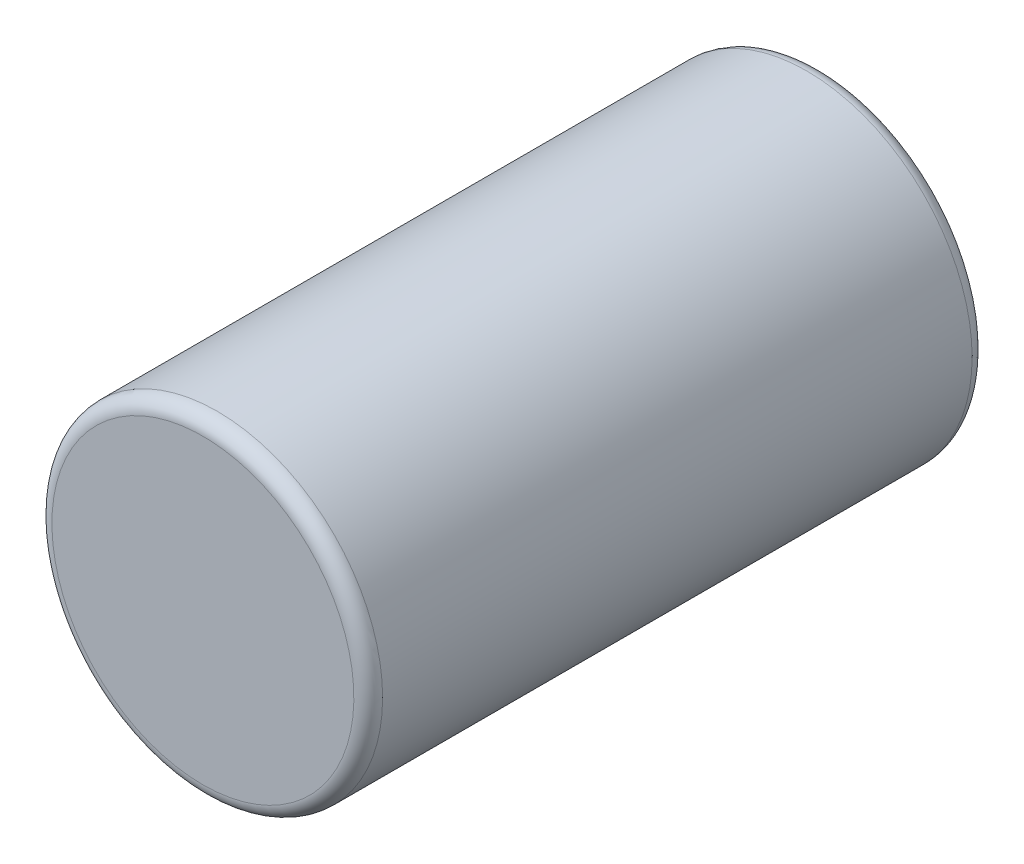
ISO-10303-21;
HEADER;
FILE_DESCRIPTION(('STEP AP214'),'2;1');
FILE_NAME('part.step','',(''),(''),'','','');
FILE_SCHEMA(('AUTOMOTIVE_DESIGN { 1 0 10303 214 1 1 1 1 }'));
ENDSEC;
DATA;
#1=APPLICATION_CONTEXT('core data for automotive mechanical design processes');
#2=APPLICATION_PROTOCOL_DEFINITION('international standard','automotive_design',2000,#1);
#3=PRODUCT_CONTEXT('',#1,'mechanical');
#4=PRODUCT('Part','Part','',(#3));
#5=PRODUCT_RELATED_PRODUCT_CATEGORY('part','',(#4));
#6=PRODUCT_DEFINITION_FORMATION('','',#4);
#7=PRODUCT_DEFINITION_CONTEXT('part definition',#1,'design');
#8=PRODUCT_DEFINITION('design','',#6,#7);
#9=PRODUCT_DEFINITION_SHAPE('','',#8);
#10=(LENGTH_UNIT() NAMED_UNIT(*) SI_UNIT(.MILLI.,.METRE.));
#11=(NAMED_UNIT(*) PLANE_ANGLE_UNIT() SI_UNIT($,.RADIAN.));
#12=(NAMED_UNIT(*) SI_UNIT($,.STERADIAN.) SOLID_ANGLE_UNIT());
#13=UNCERTAINTY_MEASURE_WITH_UNIT(LENGTH_MEASURE(1.E-05),#10,'distance_accuracy_value','');
#14=(GEOMETRIC_REPRESENTATION_CONTEXT(3) GLOBAL_UNCERTAINTY_ASSIGNED_CONTEXT((#13)) GLOBAL_UNIT_ASSIGNED_CONTEXT((#10,
#11,#12)) REPRESENTATION_CONTEXT('',''));
#15=CARTESIAN_POINT('',(0.,0.,0.));
#16=DIRECTION('',(0.,0.,1.));
#17=DIRECTION('',(1.,0.,0.));
#18=AXIS2_PLACEMENT_3D('',#15,#16,#17);
#19=CARTESIAN_POINT('',(0.,0.,0.));
#20=DIRECTION('',(0.,0.,-1.));
#21=DIRECTION('',(0.,1.,0.));
#22=AXIS2_PLACEMENT_3D('',#19,#20,#21);
#23=PLANE('',#22);
#24=CARTESIAN_POINT('',(0.,0.,0.));
#25=DIRECTION('',(0.,0.,1.));
#26=DIRECTION('',(0.,-1.,0.));
#27=AXIS2_PLACEMENT_3D('',#24,#25,#26);
#28=CIRCLE('',#27,10.5);
#29=CARTESIAN_POINT('',(0.,-10.5,0.));
#30=VERTEX_POINT('',#29);
#31=EDGE_CURVE('E10',#30,#30,#28,.T.);
#32=ORIENTED_EDGE('',*,*,#31,.T.);
#33=EDGE_LOOP('',(#32));
#34=FACE_BOUND('',#33,.T.);
#35=ADVANCED_FACE('F33',(#34),#23,.F.);
#36=CARTESIAN_POINT('',(0.,0.,-1.));
#37=DIRECTION('',(0.,0.,1.));
#38=DIRECTION('',(0.,-1.,0.));
#39=AXIS2_PLACEMENT_3D('',#36,#37,#38);
#40=TOROIDAL_SURFACE('',#39,10.5,1.);
#41=ORIENTED_EDGE('',*,*,#31,.F.);
#42=EDGE_LOOP('',(#41));
#43=FACE_BOUND('',#42,.T.);
#44=CARTESIAN_POINT('',(0.,0.,-1.00000000000001));
#45=DIRECTION('',(0.,0.,1.));
#46=DIRECTION('',(0.,-1.,0.));
#47=AXIS2_PLACEMENT_3D('',#44,#45,#46);
#48=CIRCLE('',#47,11.5);
#49=CARTESIAN_POINT('',(0.,-11.5,-1.00000000000001));
#50=VERTEX_POINT('',#49);
#51=EDGE_CURVE('E39',#50,#50,#48,.T.);
#52=ORIENTED_EDGE('',*,*,#51,.T.);
#53=EDGE_LOOP('',(#52));
#54=FACE_BOUND('',#53,.T.);
#55=ADVANCED_FACE('F77',(#43,#54),#40,.T.);
#56=CARTESIAN_POINT('',(0.,0.,0.));
#57=DIRECTION('',(0.,0.,1.));
#58=DIRECTION('',(0.,-1.,0.));
#59=AXIS2_PLACEMENT_3D('',#56,#57,#58);
#60=CYLINDRICAL_SURFACE('',#59,11.5);
#61=ORIENTED_EDGE('',*,*,#51,.F.);
#62=EDGE_LOOP('',(#61));
#63=FACE_BOUND('',#62,.T.);
#64=CARTESIAN_POINT('',(0.,0.,-42.));
#65=DIRECTION('',(0.,0.,1.));
#66=DIRECTION('',(0.,-1.,0.));
#67=AXIS2_PLACEMENT_3D('',#64,#65,#66);
#68=CIRCLE('',#67,11.5);
#69=CARTESIAN_POINT('',(0.,-11.5,-42.));
#70=VERTEX_POINT('',#69);
#71=EDGE_CURVE('E43',#70,#70,#68,.T.);
#72=ORIENTED_EDGE('',*,*,#71,.T.);
#73=EDGE_LOOP('',(#72));
#74=FACE_BOUND('',#73,.T.);
#75=ADVANCED_FACE('F81',(#63,#74),#60,.T.);
#76=CARTESIAN_POINT('',(0.,0.,-42.));
#77=DIRECTION('',(0.,0.,1.));
#78=DIRECTION('',(0.,-1.,0.));
#79=AXIS2_PLACEMENT_3D('',#76,#77,#78);
#80=TOROIDAL_SURFACE('',#79,10.5,1.);
#81=ORIENTED_EDGE('',*,*,#71,.F.);
#82=EDGE_LOOP('',(#81));
#83=FACE_BOUND('',#82,.T.);
#84=CARTESIAN_POINT('',(0.,0.,-43.));
#85=DIRECTION('',(0.,0.,1.));
#86=DIRECTION('',(0.,-1.,0.));
#87=AXIS2_PLACEMENT_3D('',#84,#85,#86);
#88=CIRCLE('',#87,10.5);
#89=CARTESIAN_POINT('',(0.,-10.5,-43.));
#90=VERTEX_POINT('',#89);
#91=EDGE_CURVE('E47',#90,#90,#88,.T.);
#92=ORIENTED_EDGE('',*,*,#91,.T.);
#93=EDGE_LOOP('',(#92));
#94=FACE_BOUND('',#93,.T.);
#95=ADVANCED_FACE('F86',(#83,#94),#80,.T.);
#96=CARTESIAN_POINT('',(0.,10.5,-43.));
#97=DIRECTION('',(0.,0.,1.));
#98=DIRECTION('',(0.,-1.,0.));
#99=AXIS2_PLACEMENT_3D('',#96,#97,#98);
#100=PLANE('',#99);
#101=ORIENTED_EDGE('',*,*,#91,.F.);
#102=EDGE_LOOP('',(#101));
#103=FACE_BOUND('',#102,.T.);
#104=CARTESIAN_POINT('',(0.,0.,-43.));
#105=DIRECTION('',(0.,0.,1.));
#106=DIRECTION('',(0.,-1.,0.));
#107=AXIS2_PLACEMENT_3D('',#104,#105,#106);
#108=CIRCLE('',#107,8.);
#109=CARTESIAN_POINT('',(0.,-8.,-43.));
#110=VERTEX_POINT('',#109);
#111=EDGE_CURVE('E52',#110,#110,#108,.T.);
#112=ORIENTED_EDGE('',*,*,#111,.T.);
#113=EDGE_LOOP('',(#112));
#114=FACE_BOUND('',#113,.T.);
#115=ADVANCED_FACE('F92',(#103,#114),#100,.F.);
#116=CARTESIAN_POINT('',(0.,0.,-42.5));
#117=DIRECTION('',(0.,0.,-1.));
#118=DIRECTION('',(0.,1.,0.));
#119=AXIS2_PLACEMENT_3D('',#116,#117,#118);
#120=CONICAL_SURFACE('',#119,7.5,0.785398163397436);
#121=ORIENTED_EDGE('',*,*,#111,.F.);
#122=EDGE_LOOP('',(#121));
#123=FACE_BOUND('',#122,.T.);
#124=CARTESIAN_POINT('',(0.,0.,-42.5));
#125=DIRECTION('',(0.,0.,1.));
#126=DIRECTION('',(0.,-1.,0.));
#127=AXIS2_PLACEMENT_3D('',#124,#125,#126);
#128=CIRCLE('',#127,7.5);
#129=CARTESIAN_POINT('',(0.,-7.5,-42.5));
#130=VERTEX_POINT('',#129);
#131=EDGE_CURVE('E55',#130,#130,#128,.T.);
#132=ORIENTED_EDGE('',*,*,#131,.T.);
#133=EDGE_LOOP('',(#132));
#134=FACE_BOUND('',#133,.T.);
#135=ADVANCED_FACE('F96',(#123,#134),#120,.F.);
#136=CARTESIAN_POINT('',(0.,7.5,-42.5));
#137=DIRECTION('',(0.,0.,1.));
#138=DIRECTION('',(0.,-1.,0.));
#139=AXIS2_PLACEMENT_3D('',#136,#137,#138);
#140=PLANE('',#139);
#141=ORIENTED_EDGE('',*,*,#131,.F.);
#142=EDGE_LOOP('',(#141));
#143=FACE_BOUND('',#142,.T.);
#144=CARTESIAN_POINT('',(0.,0.,-42.5));
#145=DIRECTION('',(0.,0.,1.));
#146=DIRECTION('',(0.,-1.,0.));
#147=AXIS2_PLACEMENT_3D('',#144,#145,#146);
#148=CIRCLE('',#147,5.);
#149=CARTESIAN_POINT('',(0.,-5.,-42.5));
#150=VERTEX_POINT('',#149);
#151=EDGE_CURVE('E58',#150,#150,#148,.T.);
#152=ORIENTED_EDGE('',*,*,#151,.T.);
#153=EDGE_LOOP('',(#152));
#154=FACE_BOUND('',#153,.T.);
#155=ADVANCED_FACE('F73',(#143,#154),#140,.F.);
#156=CARTESIAN_POINT('',(0.,0.,-43.));
#157=DIRECTION('',(0.,0.,1.));
#158=DIRECTION('',(0.,-1.,0.));
#159=AXIS2_PLACEMENT_3D('',#156,#157,#158);
#160=CONICAL_SURFACE('',#159,4.5,0.78539816339745);
#161=ORIENTED_EDGE('',*,*,#151,.F.);
#162=EDGE_LOOP('',(#161));
#163=FACE_BOUND('',#162,.T.);
#164=CARTESIAN_POINT('',(0.,0.,-43.));
#165=DIRECTION('',(0.,0.,1.));
#166=DIRECTION('',(0.,-1.,0.));
#167=AXIS2_PLACEMENT_3D('',#164,#165,#166);
#168=CIRCLE('',#167,4.5);
#169=CARTESIAN_POINT('',(0.,-4.5,-43.));
#170=VERTEX_POINT('',#169);
#171=EDGE_CURVE('E61',#170,#170,#168,.T.);
#172=ORIENTED_EDGE('',*,*,#171,.T.);
#173=EDGE_LOOP('',(#172));
#174=FACE_BOUND('',#173,.T.);
#175=ADVANCED_FACE('F65',(#163,#174),#160,.T.);
#176=CARTESIAN_POINT('',(0.,4.5,-43.));
#177=DIRECTION('',(0.,0.,1.));
#178=DIRECTION('',(0.,-1.,0.));
#179=AXIS2_PLACEMENT_3D('',#176,#177,#178);
#180=PLANE('',#179);
#181=ORIENTED_EDGE('',*,*,#171,.F.);
#182=EDGE_LOOP('',(#181));
#183=FACE_BOUND('',#182,.T.);
#184=ADVANCED_FACE('F67',(#183),#180,.F.);
#185=CLOSED_SHELL('',(#35,#55,#75,#95,#115,#135,#155,#175,#184));
#186=MANIFOLD_SOLID_BREP('B2',#185);
#187=ADVANCED_BREP_SHAPE_REPRESENTATION('',(#18,#186),#14);
#188=SHAPE_DEFINITION_REPRESENTATION(#9,#187);
ENDSEC;
END-ISO-10303-21;
